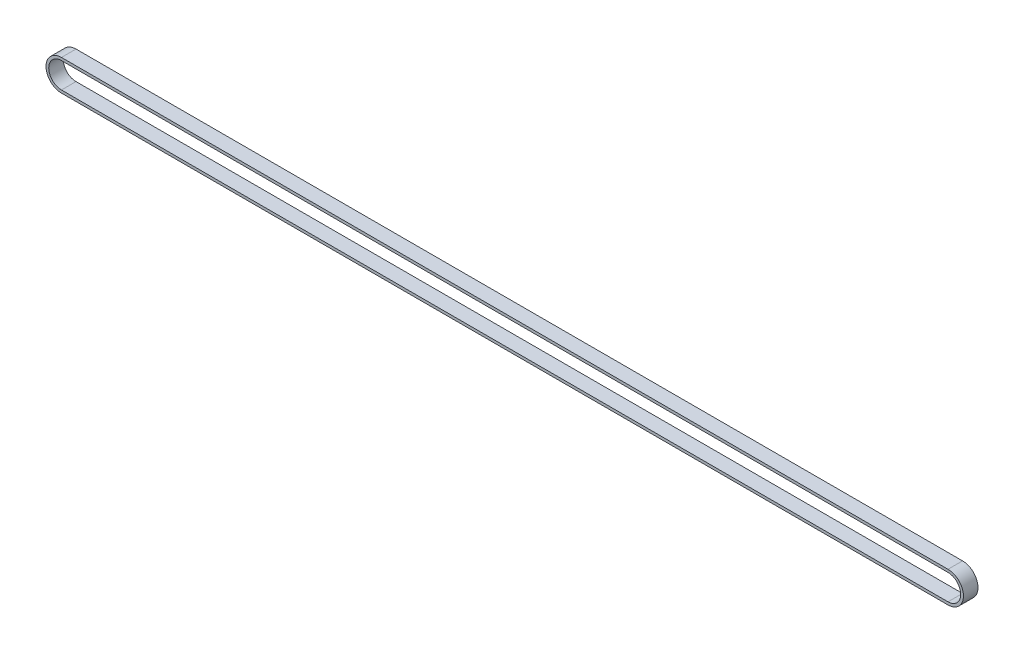
ISO-10303-21;
HEADER;
FILE_DESCRIPTION(('STEP AP214'),'2;1');
FILE_NAME('part.step','',(''),(''),'','','');
FILE_SCHEMA(('AUTOMOTIVE_DESIGN { 1 0 10303 214 1 1 1 1 }'));
ENDSEC;
DATA;
#1=APPLICATION_CONTEXT('core data for automotive mechanical design processes');
#2=APPLICATION_PROTOCOL_DEFINITION('international standard','automotive_design',2000,#1);
#3=PRODUCT_CONTEXT('',#1,'mechanical');
#4=PRODUCT('Part','Part','',(#3));
#5=PRODUCT_RELATED_PRODUCT_CATEGORY('part','',(#4));
#6=PRODUCT_DEFINITION_FORMATION('','',#4);
#7=PRODUCT_DEFINITION_CONTEXT('part definition',#1,'design');
#8=PRODUCT_DEFINITION('design','',#6,#7);
#9=PRODUCT_DEFINITION_SHAPE('','',#8);
#10=(LENGTH_UNIT() NAMED_UNIT(*) SI_UNIT(.MILLI.,.METRE.));
#11=(NAMED_UNIT(*) PLANE_ANGLE_UNIT() SI_UNIT($,.RADIAN.));
#12=(NAMED_UNIT(*) SI_UNIT($,.STERADIAN.) SOLID_ANGLE_UNIT());
#13=UNCERTAINTY_MEASURE_WITH_UNIT(LENGTH_MEASURE(1.E-05),#10,'distance_accuracy_value','');
#14=(GEOMETRIC_REPRESENTATION_CONTEXT(3) GLOBAL_UNCERTAINTY_ASSIGNED_CONTEXT((#13)) GLOBAL_UNIT_ASSIGNED_CONTEXT((#10,
#11,#12)) REPRESENTATION_CONTEXT('',''));
#15=CARTESIAN_POINT('',(0.,0.,0.));
#16=DIRECTION('',(0.,0.,1.));
#17=DIRECTION('',(1.,0.,0.));
#18=AXIS2_PLACEMENT_3D('',#15,#16,#17);
#19=CARTESIAN_POINT('',(0.,0.,6.4));
#20=DIRECTION('',(0.,0.,1.));
#21=DIRECTION('',(1.,0.,0.));
#22=AXIS2_PLACEMENT_3D('',#19,#20,#21);
#23=PLANE('',#22);
#24=CARTESIAN_POINT('',(0.,0.,6.4));
#25=DIRECTION('',(0.,0.,1.));
#26=DIRECTION('',(1.,0.,0.));
#27=AXIS2_PLACEMENT_3D('',#24,#25,#26);
#28=CIRCLE('',#27,6.80000000000008);
#29=CARTESIAN_POINT('',(0.,-6.80000000000008,6.4));
#30=VERTEX_POINT('',#29);
#31=CARTESIAN_POINT('',(0.,6.80000000000008,6.4));
#32=VERTEX_POINT('',#31);
#33=EDGE_CURVE('E143',#30,#32,#28,.T.);
#34=ORIENTED_EDGE('',*,*,#33,.T.);
#35=DIRECTION('',(-1.,0.,0.));
#36=VECTOR('',#35,1.);
#37=CARTESIAN_POINT('',(0.,6.80000000000008,6.4));
#38=LINE('',#37,#36);
#39=CARTESIAN_POINT('',(-390.,6.8,6.4));
#40=VERTEX_POINT('',#39);
#41=EDGE_CURVE('E146',#32,#40,#38,.T.);
#42=ORIENTED_EDGE('',*,*,#41,.T.);
#43=CARTESIAN_POINT('',(-390.,0.,6.4));
#44=DIRECTION('',(0.,0.,1.));
#45=DIRECTION('',(1.,0.,0.));
#46=AXIS2_PLACEMENT_3D('',#43,#44,#45);
#47=CIRCLE('',#46,6.80000000000009);
#48=CARTESIAN_POINT('',(-390.,-6.80000000000009,6.4));
#49=VERTEX_POINT('',#48);
#50=EDGE_CURVE('E149',#40,#49,#47,.T.);
#51=ORIENTED_EDGE('',*,*,#50,.T.);
#52=DIRECTION('',(1.,0.,0.));
#53=VECTOR('',#52,1.);
#54=CARTESIAN_POINT('',(0.,-6.80000000000008,6.4));
#55=LINE('',#54,#53);
#56=EDGE_CURVE('E151',#49,#30,#55,.T.);
#57=ORIENTED_EDGE('',*,*,#56,.T.);
#58=EDGE_LOOP('',(#34,#42,#51,#57));
#59=FACE_BOUND('',#58,.T.);
#60=DIRECTION('',(-1.,0.,0.));
#61=VECTOR('',#60,1.);
#62=CARTESIAN_POINT('',(0.,5.60000000000008,6.4));
#63=LINE('',#62,#61);
#64=CARTESIAN_POINT('',(0.,5.60000000000008,6.4));
#65=VERTEX_POINT('',#64);
#66=CARTESIAN_POINT('',(-390.,5.60000000000008,6.4));
#67=VERTEX_POINT('',#66);
#68=EDGE_CURVE('E115',#65,#67,#63,.T.);
#69=ORIENTED_EDGE('',*,*,#68,.F.);
#70=CARTESIAN_POINT('',(0.,0.,6.4));
#71=DIRECTION('',(0.,0.,1.));
#72=DIRECTION('',(1.,0.,0.));
#73=AXIS2_PLACEMENT_3D('',#70,#71,#72);
#74=CIRCLE('',#73,5.60000000000008);
#75=CARTESIAN_POINT('',(0.,-5.60000000000008,6.4));
#76=VERTEX_POINT('',#75);
#77=EDGE_CURVE('E107',#76,#65,#74,.T.);
#78=ORIENTED_EDGE('',*,*,#77,.F.);
#79=DIRECTION('',(1.,0.,0.));
#80=VECTOR('',#79,1.);
#81=CARTESIAN_POINT('',(0.,-5.60000000000008,6.4));
#82=LINE('',#81,#80);
#83=CARTESIAN_POINT('',(-390.,-5.60000000000025,6.4));
#84=VERTEX_POINT('',#83);
#85=EDGE_CURVE('E129',#84,#76,#82,.T.);
#86=ORIENTED_EDGE('',*,*,#85,.F.);
#87=CARTESIAN_POINT('',(-390.,0.,6.4));
#88=DIRECTION('',(0.,0.,1.));
#89=DIRECTION('',(1.,0.,0.));
#90=AXIS2_PLACEMENT_3D('',#87,#88,#89);
#91=CIRCLE('',#90,5.60000000000017);
#92=EDGE_CURVE('E127',#67,#84,#91,.T.);
#93=ORIENTED_EDGE('',*,*,#92,.F.);
#94=EDGE_LOOP('',(#69,#78,#86,#93));
#95=FACE_BOUND('',#94,.T.);
#96=ADVANCED_FACE('F42',(#59,#95),#23,.T.);
#97=CARTESIAN_POINT('',(0.,0.,0.));
#98=DIRECTION('',(0.,0.,1.));
#99=DIRECTION('',(1.,0.,0.));
#100=AXIS2_PLACEMENT_3D('',#97,#98,#99);
#101=PLANE('',#100);
#102=CARTESIAN_POINT('',(0.,0.,0.));
#103=DIRECTION('',(0.,0.,1.));
#104=DIRECTION('',(1.,0.,0.));
#105=AXIS2_PLACEMENT_3D('',#102,#103,#104);
#106=CIRCLE('',#105,6.80000000000008);
#107=CARTESIAN_POINT('',(0.,-6.80000000000008,0.));
#108=VERTEX_POINT('',#107);
#109=CARTESIAN_POINT('',(0.,6.80000000000008,0.));
#110=VERTEX_POINT('',#109);
#111=EDGE_CURVE('E123',#108,#110,#106,.T.);
#112=ORIENTED_EDGE('',*,*,#111,.F.);
#113=DIRECTION('',(1.,0.,0.));
#114=VECTOR('',#113,1.);
#115=CARTESIAN_POINT('',(0.,-6.80000000000008,0.));
#116=LINE('',#115,#114);
#117=CARTESIAN_POINT('',(-390.,-6.80000000000009,0.));
#118=VERTEX_POINT('',#117);
#119=EDGE_CURVE('E147',#118,#108,#116,.T.);
#120=ORIENTED_EDGE('',*,*,#119,.F.);
#121=CARTESIAN_POINT('',(-390.,0.,0.));
#122=DIRECTION('',(0.,0.,1.));
#123=DIRECTION('',(1.,0.,0.));
#124=AXIS2_PLACEMENT_3D('',#121,#122,#123);
#125=CIRCLE('',#124,6.80000000000009);
#126=CARTESIAN_POINT('',(-390.,6.8,0.));
#127=VERTEX_POINT('',#126);
#128=EDGE_CURVE('E158',#127,#118,#125,.T.);
#129=ORIENTED_EDGE('',*,*,#128,.F.);
#130=DIRECTION('',(-1.,0.,0.));
#131=VECTOR('',#130,1.);
#132=CARTESIAN_POINT('',(0.,6.80000000000008,0.));
#133=LINE('',#132,#131);
#134=EDGE_CURVE('E156',#110,#127,#133,.T.);
#135=ORIENTED_EDGE('',*,*,#134,.F.);
#136=EDGE_LOOP('',(#112,#120,#129,#135));
#137=FACE_BOUND('',#136,.T.);
#138=CARTESIAN_POINT('',(0.,0.,0.));
#139=DIRECTION('',(0.,0.,1.));
#140=DIRECTION('',(1.,0.,0.));
#141=AXIS2_PLACEMENT_3D('',#138,#139,#140);
#142=CIRCLE('',#141,5.60000000000008);
#143=CARTESIAN_POINT('',(0.,-5.60000000000008,0.));
#144=VERTEX_POINT('',#143);
#145=CARTESIAN_POINT('',(0.,5.60000000000008,0.));
#146=VERTEX_POINT('',#145);
#147=EDGE_CURVE('E65',#144,#146,#142,.T.);
#148=ORIENTED_EDGE('',*,*,#147,.T.);
#149=DIRECTION('',(-1.,0.,0.));
#150=VECTOR('',#149,1.);
#151=CARTESIAN_POINT('',(0.,5.60000000000008,0.));
#152=LINE('',#151,#150);
#153=CARTESIAN_POINT('',(-390.,5.60000000000008,0.));
#154=VERTEX_POINT('',#153);
#155=EDGE_CURVE('E122',#146,#154,#152,.T.);
#156=ORIENTED_EDGE('',*,*,#155,.T.);
#157=CARTESIAN_POINT('',(-390.,0.,0.));
#158=DIRECTION('',(0.,0.,1.));
#159=DIRECTION('',(1.,0.,0.));
#160=AXIS2_PLACEMENT_3D('',#157,#158,#159);
#161=CIRCLE('',#160,5.60000000000017);
#162=CARTESIAN_POINT('',(-390.,-5.60000000000025,0.));
#163=VERTEX_POINT('',#162);
#164=EDGE_CURVE('E135',#154,#163,#161,.T.);
#165=ORIENTED_EDGE('',*,*,#164,.T.);
#166=DIRECTION('',(1.,0.,0.));
#167=VECTOR('',#166,1.);
#168=CARTESIAN_POINT('',(0.,-5.60000000000008,0.));
#169=LINE('',#168,#167);
#170=EDGE_CURVE('E116',#163,#144,#169,.T.);
#171=ORIENTED_EDGE('',*,*,#170,.T.);
#172=EDGE_LOOP('',(#148,#156,#165,#171));
#173=FACE_BOUND('',#172,.T.);
#174=ADVANCED_FACE('F176',(#137,#173),#101,.F.);
#175=CARTESIAN_POINT('',(0.,0.,6.4));
#176=DIRECTION('',(0.,0.,-1.));
#177=DIRECTION('',(-1.,0.,0.));
#178=AXIS2_PLACEMENT_3D('',#175,#176,#177);
#179=CYLINDRICAL_SURFACE('',#178,6.80000000000008);
#180=ORIENTED_EDGE('',*,*,#111,.T.);
#181=DIRECTION('',(0.,0.,-1.));
#182=VECTOR('',#181,1.);
#183=CARTESIAN_POINT('',(0.,6.80000000000008,6.4));
#184=LINE('',#183,#182);
#185=EDGE_CURVE('E13',#32,#110,#184,.T.);
#186=ORIENTED_EDGE('',*,*,#185,.F.);
#187=ORIENTED_EDGE('',*,*,#33,.F.);
#188=DIRECTION('',(0.,0.,-1.));
#189=VECTOR('',#188,1.);
#190=CARTESIAN_POINT('',(0.,-6.80000000000008,6.4));
#191=LINE('',#190,#189);
#192=EDGE_CURVE('E153',#30,#108,#191,.T.);
#193=ORIENTED_EDGE('',*,*,#192,.T.);
#194=EDGE_LOOP('',(#180,#186,#187,#193));
#195=FACE_BOUND('',#194,.T.);
#196=ADVANCED_FACE('F44',(#195),#179,.T.);
#197=CARTESIAN_POINT('',(0.,6.80000000000008,6.4));
#198=DIRECTION('',(0.,-1.,0.));
#199=DIRECTION('',(1.,0.,0.));
#200=AXIS2_PLACEMENT_3D('',#197,#198,#199);
#201=PLANE('',#200);
#202=ORIENTED_EDGE('',*,*,#134,.T.);
#203=DIRECTION('',(0.,0.,-1.));
#204=VECTOR('',#203,1.);
#205=CARTESIAN_POINT('',(-390.,6.8,6.4));
#206=LINE('',#205,#204);
#207=EDGE_CURVE('E50',#40,#127,#206,.T.);
#208=ORIENTED_EDGE('',*,*,#207,.F.);
#209=ORIENTED_EDGE('',*,*,#41,.F.);
#210=ORIENTED_EDGE('',*,*,#185,.T.);
#211=EDGE_LOOP('',(#202,#208,#209,#210));
#212=FACE_BOUND('',#211,.T.);
#213=ADVANCED_FACE('F186',(#212),#201,.F.);
#214=CARTESIAN_POINT('',(-390.,0.,6.4));
#215=DIRECTION('',(0.,0.,-1.));
#216=DIRECTION('',(-1.,0.,0.));
#217=AXIS2_PLACEMENT_3D('',#214,#215,#216);
#218=CYLINDRICAL_SURFACE('',#217,6.80000000000009);
#219=ORIENTED_EDGE('',*,*,#128,.T.);
#220=DIRECTION('',(0.,0.,-1.));
#221=VECTOR('',#220,1.);
#222=CARTESIAN_POINT('',(-390.,-6.80000000000009,6.4));
#223=LINE('',#222,#221);
#224=EDGE_CURVE('E163',#49,#118,#223,.T.);
#225=ORIENTED_EDGE('',*,*,#224,.F.);
#226=ORIENTED_EDGE('',*,*,#50,.F.);
#227=ORIENTED_EDGE('',*,*,#207,.T.);
#228=EDGE_LOOP('',(#219,#225,#226,#227));
#229=FACE_BOUND('',#228,.T.);
#230=ADVANCED_FACE('F170',(#229),#218,.T.);
#231=CARTESIAN_POINT('',(0.,-6.80000000000008,6.4));
#232=DIRECTION('',(0.,1.,0.));
#233=DIRECTION('',(-1.,0.,0.));
#234=AXIS2_PLACEMENT_3D('',#231,#232,#233);
#235=PLANE('',#234);
#236=ORIENTED_EDGE('',*,*,#119,.T.);
#237=ORIENTED_EDGE('',*,*,#192,.F.);
#238=ORIENTED_EDGE('',*,*,#56,.F.);
#239=ORIENTED_EDGE('',*,*,#224,.T.);
#240=EDGE_LOOP('',(#236,#237,#238,#239));
#241=FACE_BOUND('',#240,.T.);
#242=ADVANCED_FACE('F180',(#241),#235,.F.);
#243=CARTESIAN_POINT('',(0.,0.,6.4));
#244=DIRECTION('',(0.,0.,-1.));
#245=DIRECTION('',(-1.,0.,0.));
#246=AXIS2_PLACEMENT_3D('',#243,#244,#245);
#247=CYLINDRICAL_SURFACE('',#246,5.60000000000008);
#248=ORIENTED_EDGE('',*,*,#147,.F.);
#249=DIRECTION('',(0.,0.,-1.));
#250=VECTOR('',#249,1.);
#251=CARTESIAN_POINT('',(0.,-5.60000000000008,6.4));
#252=LINE('',#251,#250);
#253=EDGE_CURVE('E111',#76,#144,#252,.T.);
#254=ORIENTED_EDGE('',*,*,#253,.F.);
#255=ORIENTED_EDGE('',*,*,#77,.T.);
#256=DIRECTION('',(0.,0.,-1.));
#257=VECTOR('',#256,1.);
#258=CARTESIAN_POINT('',(0.,5.60000000000008,6.4));
#259=LINE('',#258,#257);
#260=EDGE_CURVE('E110',#65,#146,#259,.T.);
#261=ORIENTED_EDGE('',*,*,#260,.T.);
#262=EDGE_LOOP('',(#248,#254,#255,#261));
#263=FACE_BOUND('',#262,.T.);
#264=ADVANCED_FACE('F109',(#263),#247,.F.);
#265=CARTESIAN_POINT('',(0.,5.60000000000008,6.4));
#266=DIRECTION('',(0.,-1.,0.));
#267=DIRECTION('',(1.,0.,0.));
#268=AXIS2_PLACEMENT_3D('',#265,#266,#267);
#269=PLANE('',#268);
#270=ORIENTED_EDGE('',*,*,#155,.F.);
#271=ORIENTED_EDGE('',*,*,#260,.F.);
#272=ORIENTED_EDGE('',*,*,#68,.T.);
#273=DIRECTION('',(0.,0.,-1.));
#274=VECTOR('',#273,1.);
#275=CARTESIAN_POINT('',(-390.,5.60000000000008,6.4));
#276=LINE('',#275,#274);
#277=EDGE_CURVE('E124',#67,#154,#276,.T.);
#278=ORIENTED_EDGE('',*,*,#277,.T.);
#279=EDGE_LOOP('',(#270,#271,#272,#278));
#280=FACE_BOUND('',#279,.T.);
#281=ADVANCED_FACE('F119',(#280),#269,.T.);
#282=CARTESIAN_POINT('',(-390.,0.,6.4));
#283=DIRECTION('',(0.,0.,-1.));
#284=DIRECTION('',(-1.,0.,0.));
#285=AXIS2_PLACEMENT_3D('',#282,#283,#284);
#286=CYLINDRICAL_SURFACE('',#285,5.60000000000017);
#287=ORIENTED_EDGE('',*,*,#164,.F.);
#288=ORIENTED_EDGE('',*,*,#277,.F.);
#289=ORIENTED_EDGE('',*,*,#92,.T.);
#290=DIRECTION('',(0.,0.,-1.));
#291=VECTOR('',#290,1.);
#292=CARTESIAN_POINT('',(-390.,-5.60000000000025,6.4));
#293=LINE('',#292,#291);
#294=EDGE_CURVE('E57',#84,#163,#293,.T.);
#295=ORIENTED_EDGE('',*,*,#294,.T.);
#296=EDGE_LOOP('',(#287,#288,#289,#295));
#297=FACE_BOUND('',#296,.T.);
#298=ADVANCED_FACE('F209',(#297),#286,.F.);
#299=CARTESIAN_POINT('',(0.,-5.60000000000008,6.4));
#300=DIRECTION('',(0.,1.,0.));
#301=DIRECTION('',(-1.,0.,0.));
#302=AXIS2_PLACEMENT_3D('',#299,#300,#301);
#303=PLANE('',#302);
#304=ORIENTED_EDGE('',*,*,#170,.F.);
#305=ORIENTED_EDGE('',*,*,#294,.F.);
#306=ORIENTED_EDGE('',*,*,#85,.T.);
#307=ORIENTED_EDGE('',*,*,#253,.T.);
#308=EDGE_LOOP('',(#304,#305,#306,#307));
#309=FACE_BOUND('',#308,.T.);
#310=ADVANCED_FACE('F213',(#309),#303,.T.);
#311=CLOSED_SHELL('',(#96,#174,#196,#213,#230,#242,#264,#281,#298,#310));
#312=MANIFOLD_SOLID_BREP('B2',#311);
#313=ADVANCED_BREP_SHAPE_REPRESENTATION('',(#18,#312),#14);
#314=SHAPE_DEFINITION_REPRESENTATION(#9,#313);
ENDSEC;
END-ISO-10303-21;
